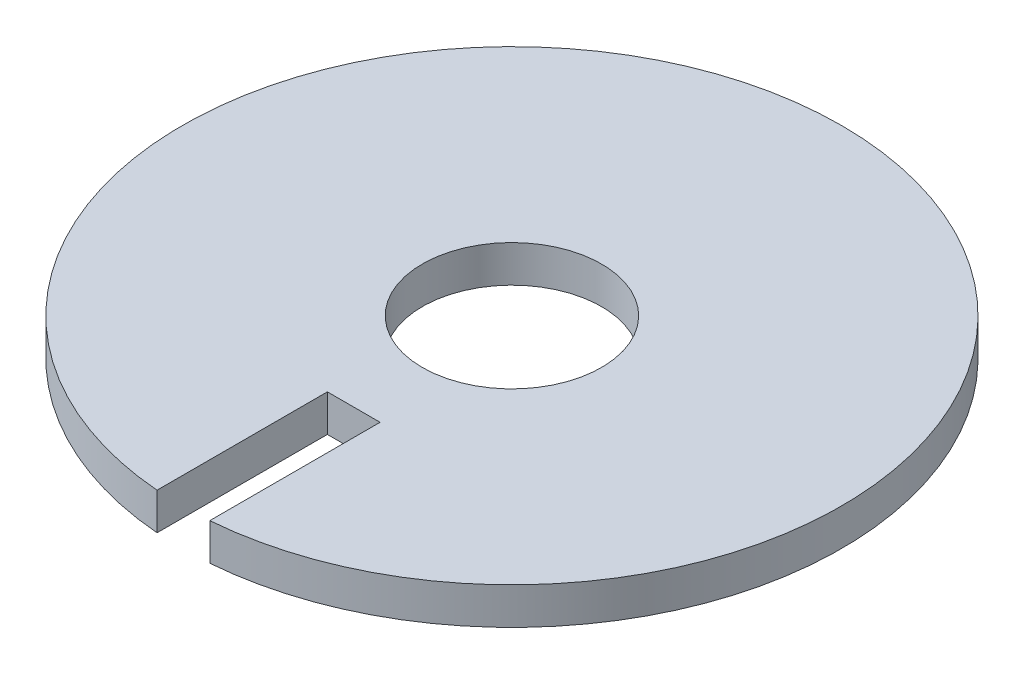
ISO-10303-21;
HEADER;
FILE_DESCRIPTION(('STEP AP214'),'2;1');
FILE_NAME('part.step','',(''),(''),'','','');
FILE_SCHEMA(('AUTOMOTIVE_DESIGN { 1 0 10303 214 1 1 1 1 }'));
ENDSEC;
DATA;
#1=APPLICATION_CONTEXT('core data for automotive mechanical design processes');
#2=APPLICATION_PROTOCOL_DEFINITION('international standard','automotive_design',2000,#1);
#3=PRODUCT_CONTEXT('',#1,'mechanical');
#4=PRODUCT('Part','Part','',(#3));
#5=PRODUCT_RELATED_PRODUCT_CATEGORY('part','',(#4));
#6=PRODUCT_DEFINITION_FORMATION('','',#4);
#7=PRODUCT_DEFINITION_CONTEXT('part definition',#1,'design');
#8=PRODUCT_DEFINITION('design','',#6,#7);
#9=PRODUCT_DEFINITION_SHAPE('','',#8);
#10=(LENGTH_UNIT() NAMED_UNIT(*) SI_UNIT(.MILLI.,.METRE.));
#11=(NAMED_UNIT(*) PLANE_ANGLE_UNIT() SI_UNIT($,.RADIAN.));
#12=(NAMED_UNIT(*) SI_UNIT($,.STERADIAN.) SOLID_ANGLE_UNIT());
#13=UNCERTAINTY_MEASURE_WITH_UNIT(LENGTH_MEASURE(1.E-05),#10,'distance_accuracy_value','');
#14=(GEOMETRIC_REPRESENTATION_CONTEXT(3) GLOBAL_UNCERTAINTY_ASSIGNED_CONTEXT((#13)) GLOBAL_UNIT_ASSIGNED_CONTEXT((#10,
#11,#12)) REPRESENTATION_CONTEXT('',''));
#15=CARTESIAN_POINT('',(0.,0.,0.));
#16=DIRECTION('',(0.,0.,1.));
#17=DIRECTION('',(1.,0.,0.));
#18=AXIS2_PLACEMENT_3D('',#15,#16,#17);
#19=CARTESIAN_POINT('',(0.,-0.7,0.));
#20=DIRECTION('',(0.,1.,0.));
#21=DIRECTION('',(0.,0.,1.));
#22=AXIS2_PLACEMENT_3D('',#19,#20,#21);
#23=CYLINDRICAL_SURFACE('',#22,6.25000000000001);
#24=CARTESIAN_POINT('',(0.,0.,0.));
#25=DIRECTION('',(0.,1.,0.));
#26=DIRECTION('',(0.,0.,1.));
#27=AXIS2_PLACEMENT_3D('',#24,#25,#26);
#28=CIRCLE('',#27,6.25000000000001);
#29=CARTESIAN_POINT('',(0.5,0.,6.22996789718856));
#30=VERTEX_POINT('',#29);
#31=CARTESIAN_POINT('',(-0.5,0.,6.22996789718856));
#32=VERTEX_POINT('',#31);
#33=EDGE_CURVE('E40',#30,#32,#28,.T.);
#34=ORIENTED_EDGE('',*,*,#33,.F.);
#35=DIRECTION('',(0.,1.,0.));
#36=VECTOR('',#35,1.);
#37=CARTESIAN_POINT('',(0.5,0.,6.22996789718856));
#38=LINE('',#37,#36);
#39=CARTESIAN_POINT('',(0.5,-0.7,6.22996789718856));
#40=VERTEX_POINT('',#39);
#41=EDGE_CURVE('E82',#30,#40,#38,.F.);
#42=ORIENTED_EDGE('',*,*,#41,.T.);
#43=CARTESIAN_POINT('',(0.,-0.7,0.));
#44=DIRECTION('',(0.,1.,0.));
#45=DIRECTION('',(0.,0.,1.));
#46=AXIS2_PLACEMENT_3D('',#43,#44,#45);
#47=CIRCLE('',#46,6.25000000000001);
#48=CARTESIAN_POINT('',(-0.5,-0.7,6.22996789718856));
#49=VERTEX_POINT('',#48);
#50=EDGE_CURVE('E11',#40,#49,#47,.T.);
#51=ORIENTED_EDGE('',*,*,#50,.T.);
#52=DIRECTION('',(0.,1.,0.));
#53=VECTOR('',#52,1.);
#54=CARTESIAN_POINT('',(-0.5,0.,6.22996789718856));
#55=LINE('',#54,#53);
#56=EDGE_CURVE('E105',#32,#49,#55,.F.);
#57=ORIENTED_EDGE('',*,*,#56,.F.);
#58=EDGE_LOOP('',(#34,#42,#51,#57));
#59=FACE_BOUND('',#58,.T.);
#60=ADVANCED_FACE('F37',(#59),#23,.T.);
#61=CARTESIAN_POINT('',(0.,-0.7,0.));
#62=DIRECTION('',(0.,1.,0.));
#63=DIRECTION('',(0.,0.,1.));
#64=AXIS2_PLACEMENT_3D('',#61,#62,#63);
#65=PLANE('',#64);
#66=CARTESIAN_POINT('',(0.,-0.7,0.));
#67=DIRECTION('',(0.,1.,0.));
#68=DIRECTION('',(0.,0.,1.));
#69=AXIS2_PLACEMENT_3D('',#66,#67,#68);
#70=CIRCLE('',#69,1.7);
#71=CARTESIAN_POINT('',(0.,-0.7,1.7));
#72=VERTEX_POINT('',#71);
#73=EDGE_CURVE('E94',#72,#72,#70,.T.);
#74=ORIENTED_EDGE('',*,*,#73,.T.);
#75=EDGE_LOOP('',(#74));
#76=FACE_BOUND('',#75,.T.);
#77=DIRECTION('',(0.,0.,1.));
#78=VECTOR('',#77,1.);
#79=CARTESIAN_POINT('',(0.5,-0.7,0.));
#80=LINE('',#79,#78);
#81=CARTESIAN_POINT('',(0.5,-0.7,3.));
#82=VERTEX_POINT('',#81);
#83=EDGE_CURVE('E107',#40,#82,#80,.F.);
#84=ORIENTED_EDGE('',*,*,#83,.T.);
#85=DIRECTION('',(1.,0.,0.));
#86=VECTOR('',#85,1.);
#87=CARTESIAN_POINT('',(0.,-0.7,3.));
#88=LINE('',#87,#86);
#89=CARTESIAN_POINT('',(-0.5,-0.7,3.));
#90=VERTEX_POINT('',#89);
#91=EDGE_CURVE('E59',#82,#90,#88,.F.);
#92=ORIENTED_EDGE('',*,*,#91,.T.);
#93=DIRECTION('',(0.,0.,1.));
#94=VECTOR('',#93,1.);
#95=CARTESIAN_POINT('',(-0.5,-0.7,0.));
#96=LINE('',#95,#94);
#97=EDGE_CURVE('E101',#90,#49,#96,.T.);
#98=ORIENTED_EDGE('',*,*,#97,.T.);
#99=ORIENTED_EDGE('',*,*,#50,.F.);
#100=EDGE_LOOP('',(#84,#92,#98,#99));
#101=FACE_BOUND('',#100,.T.);
#102=ADVANCED_FACE('F119',(#76,#101),#65,.F.);
#103=CARTESIAN_POINT('',(0.,0.,0.));
#104=DIRECTION('',(0.,1.,0.));
#105=DIRECTION('',(0.,0.,1.));
#106=AXIS2_PLACEMENT_3D('',#103,#104,#105);
#107=PLANE('',#106);
#108=CARTESIAN_POINT('',(0.,0.,0.));
#109=DIRECTION('',(0.,1.,0.));
#110=DIRECTION('',(0.,0.,1.));
#111=AXIS2_PLACEMENT_3D('',#108,#109,#110);
#112=CIRCLE('',#111,1.7);
#113=CARTESIAN_POINT('',(0.,0.,1.7));
#114=VERTEX_POINT('',#113);
#115=EDGE_CURVE('E98',#114,#114,#112,.T.);
#116=ORIENTED_EDGE('',*,*,#115,.F.);
#117=EDGE_LOOP('',(#116));
#118=FACE_BOUND('',#117,.T.);
#119=DIRECTION('',(-1.,0.,0.));
#120=VECTOR('',#119,1.);
#121=CARTESIAN_POINT('',(-0.5,0.,3.));
#122=LINE('',#121,#120);
#123=CARTESIAN_POINT('',(0.5,0.,3.));
#124=VERTEX_POINT('',#123);
#125=CARTESIAN_POINT('',(-0.5,0.,3.));
#126=VERTEX_POINT('',#125);
#127=EDGE_CURVE('E90',#124,#126,#122,.T.);
#128=ORIENTED_EDGE('',*,*,#127,.F.);
#129=DIRECTION('',(0.,0.,-1.));
#130=VECTOR('',#129,1.);
#131=CARTESIAN_POINT('',(0.5,0.,0.));
#132=LINE('',#131,#130);
#133=EDGE_CURVE('E77',#30,#124,#132,.T.);
#134=ORIENTED_EDGE('',*,*,#133,.F.);
#135=ORIENTED_EDGE('',*,*,#33,.T.);
#136=DIRECTION('',(0.,0.,1.));
#137=VECTOR('',#136,1.);
#138=CARTESIAN_POINT('',(-0.5,0.,3.));
#139=LINE('',#138,#137);
#140=EDGE_CURVE('E87',#126,#32,#139,.T.);
#141=ORIENTED_EDGE('',*,*,#140,.F.);
#142=EDGE_LOOP('',(#128,#134,#135,#141));
#143=FACE_BOUND('',#142,.T.);
#144=ADVANCED_FACE('F93',(#118,#143),#107,.T.);
#145=CARTESIAN_POINT('',(0.5,0.,0.));
#146=DIRECTION('',(1.,0.,0.));
#147=DIRECTION('',(0.,0.,-1.));
#148=AXIS2_PLACEMENT_3D('',#145,#146,#147);
#149=PLANE('',#148);
#150=ORIENTED_EDGE('',*,*,#41,.F.);
#151=ORIENTED_EDGE('',*,*,#133,.T.);
#152=DIRECTION('',(0.,1.,0.));
#153=VECTOR('',#152,1.);
#154=CARTESIAN_POINT('',(0.5,0.,3.));
#155=LINE('',#154,#153);
#156=EDGE_CURVE('E79',#124,#82,#155,.F.);
#157=ORIENTED_EDGE('',*,*,#156,.T.);
#158=ORIENTED_EDGE('',*,*,#83,.F.);
#159=EDGE_LOOP('',(#150,#151,#157,#158));
#160=FACE_BOUND('',#159,.T.);
#161=ADVANCED_FACE('F78',(#160),#149,.F.);
#162=CARTESIAN_POINT('',(-0.5,0.,3.));
#163=DIRECTION('',(0.,0.,-1.));
#164=DIRECTION('',(-1.,0.,0.));
#165=AXIS2_PLACEMENT_3D('',#162,#163,#164);
#166=PLANE('',#165);
#167=ORIENTED_EDGE('',*,*,#156,.F.);
#168=ORIENTED_EDGE('',*,*,#127,.T.);
#169=DIRECTION('',(0.,1.,0.));
#170=VECTOR('',#169,1.);
#171=CARTESIAN_POINT('',(-0.5,0.,3.));
#172=LINE('',#171,#170);
#173=EDGE_CURVE('E51',#126,#90,#172,.F.);
#174=ORIENTED_EDGE('',*,*,#173,.T.);
#175=ORIENTED_EDGE('',*,*,#91,.F.);
#176=EDGE_LOOP('',(#167,#168,#174,#175));
#177=FACE_BOUND('',#176,.T.);
#178=ADVANCED_FACE('F89',(#177),#166,.F.);
#179=CARTESIAN_POINT('',(-0.5,0.,3.));
#180=DIRECTION('',(-1.,0.,0.));
#181=DIRECTION('',(0.,0.,1.));
#182=AXIS2_PLACEMENT_3D('',#179,#180,#181);
#183=PLANE('',#182);
#184=ORIENTED_EDGE('',*,*,#140,.T.);
#185=ORIENTED_EDGE('',*,*,#56,.T.);
#186=ORIENTED_EDGE('',*,*,#97,.F.);
#187=ORIENTED_EDGE('',*,*,#173,.F.);
#188=EDGE_LOOP('',(#184,#185,#186,#187));
#189=FACE_BOUND('',#188,.T.);
#190=ADVANCED_FACE('F132',(#189),#183,.F.);
#191=CARTESIAN_POINT('',(0.,-0.7,0.));
#192=DIRECTION('',(0.,1.,0.));
#193=DIRECTION('',(0.,0.,1.));
#194=AXIS2_PLACEMENT_3D('',#191,#192,#193);
#195=CYLINDRICAL_SURFACE('',#194,1.7);
#196=ORIENTED_EDGE('',*,*,#73,.F.);
#197=EDGE_LOOP('',(#196));
#198=FACE_BOUND('',#197,.T.);
#199=ORIENTED_EDGE('',*,*,#115,.T.);
#200=EDGE_LOOP('',(#199));
#201=FACE_BOUND('',#200,.T.);
#202=ADVANCED_FACE('F116',(#198,#201),#195,.F.);
#203=CLOSED_SHELL('',(#60,#102,#144,#161,#178,#190,#202));
#204=MANIFOLD_SOLID_BREP('B2',#203);
#205=ADVANCED_BREP_SHAPE_REPRESENTATION('',(#18,#204),#14);
#206=SHAPE_DEFINITION_REPRESENTATION(#9,#205);
ENDSEC;
END-ISO-10303-21;
